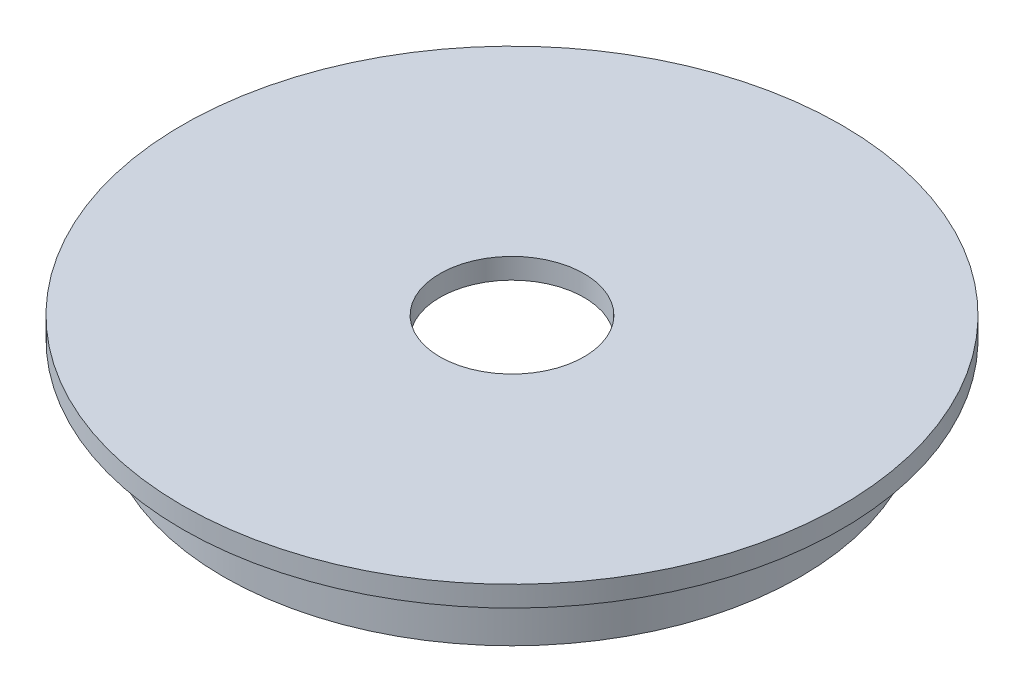
ISO-10303-21;
HEADER;
FILE_DESCRIPTION(('STEP AP214'),'2;1');
FILE_NAME('part.step','',(''),(''),'','','');
FILE_SCHEMA(('AUTOMOTIVE_DESIGN { 1 0 10303 214 1 1 1 1 }'));
ENDSEC;
DATA;
#1=APPLICATION_CONTEXT('core data for automotive mechanical design processes');
#2=APPLICATION_PROTOCOL_DEFINITION('international standard','automotive_design',2000,#1);
#3=PRODUCT_CONTEXT('',#1,'mechanical');
#4=PRODUCT('Part','Part','',(#3));
#5=PRODUCT_RELATED_PRODUCT_CATEGORY('part','',(#4));
#6=PRODUCT_DEFINITION_FORMATION('','',#4);
#7=PRODUCT_DEFINITION_CONTEXT('part definition',#1,'design');
#8=PRODUCT_DEFINITION('design','',#6,#7);
#9=PRODUCT_DEFINITION_SHAPE('','',#8);
#10=(LENGTH_UNIT() NAMED_UNIT(*) SI_UNIT(.MILLI.,.METRE.));
#11=(NAMED_UNIT(*) PLANE_ANGLE_UNIT() SI_UNIT($,.RADIAN.));
#12=(NAMED_UNIT(*) SI_UNIT($,.STERADIAN.) SOLID_ANGLE_UNIT());
#13=UNCERTAINTY_MEASURE_WITH_UNIT(LENGTH_MEASURE(1.E-05),#10,'distance_accuracy_value','');
#14=(GEOMETRIC_REPRESENTATION_CONTEXT(3) GLOBAL_UNCERTAINTY_ASSIGNED_CONTEXT((#13)) GLOBAL_UNIT_ASSIGNED_CONTEXT((#10,
#11,#12)) REPRESENTATION_CONTEXT('',''));
#15=CARTESIAN_POINT('',(0.,0.,0.));
#16=DIRECTION('',(0.,0.,1.));
#17=DIRECTION('',(1.,0.,0.));
#18=AXIS2_PLACEMENT_3D('',#15,#16,#17);
#19=CARTESIAN_POINT('',(0.,0.,0.));
#20=DIRECTION('',(0.,-1.,0.));
#21=DIRECTION('',(0.,0.,-1.));
#22=AXIS2_PLACEMENT_3D('',#19,#20,#21);
#23=PLANE('',#22);
#24=CARTESIAN_POINT('',(0.,0.,0.));
#25=DIRECTION('',(0.,1.,0.));
#26=DIRECTION('',(0.,0.,1.));
#27=AXIS2_PLACEMENT_3D('',#24,#25,#26);
#28=CIRCLE('',#27,11.1125);
#29=CARTESIAN_POINT('',(0.,0.,11.1125));
#30=VERTEX_POINT('',#29);
#31=EDGE_CURVE('E56',#30,#30,#28,.T.);
#32=ORIENTED_EDGE('',*,*,#31,.F.);
#33=EDGE_LOOP('',(#32));
#34=FACE_BOUND('',#33,.T.);
#35=CARTESIAN_POINT('',(0.,0.,0.));
#36=DIRECTION('',(0.,-1.,0.));
#37=DIRECTION('',(0.,0.,-1.));
#38=AXIS2_PLACEMENT_3D('',#35,#36,#37);
#39=CIRCLE('',#38,50.8);
#40=CARTESIAN_POINT('',(0.,0.,-50.8));
#41=VERTEX_POINT('',#40);
#42=EDGE_CURVE('E10',#41,#41,#39,.T.);
#43=ORIENTED_EDGE('',*,*,#42,.F.);
#44=EDGE_LOOP('',(#43));
#45=FACE_BOUND('',#44,.T.);
#46=ADVANCED_FACE('F31',(#34,#45),#23,.F.);
#47=CARTESIAN_POINT('',(0.,-12.7,0.));
#48=DIRECTION('',(0.,-1.,0.));
#49=DIRECTION('',(0.,0.,-1.));
#50=AXIS2_PLACEMENT_3D('',#47,#48,#49);
#51=CYLINDRICAL_SURFACE('',#50,50.8);
#52=CARTESIAN_POINT('',(0.,-3.17500000000001,0.));
#53=DIRECTION('',(0.,-1.,0.));
#54=DIRECTION('',(0.,0.,-1.));
#55=AXIS2_PLACEMENT_3D('',#52,#53,#54);
#56=CIRCLE('',#55,50.8);
#57=CARTESIAN_POINT('',(0.,-3.17500000000001,-50.8));
#58=VERTEX_POINT('',#57);
#59=EDGE_CURVE('E38',#58,#58,#56,.T.);
#60=ORIENTED_EDGE('',*,*,#59,.F.);
#61=EDGE_LOOP('',(#60));
#62=FACE_BOUND('',#61,.T.);
#63=ORIENTED_EDGE('',*,*,#42,.T.);
#64=EDGE_LOOP('',(#63));
#65=FACE_BOUND('',#64,.T.);
#66=ADVANCED_FACE('F76',(#62,#65),#51,.T.);
#67=CARTESIAN_POINT('',(-50.8,-3.17500000000001,0.));
#68=DIRECTION('',(0.,1.,0.));
#69=DIRECTION('',(0.,0.,1.));
#70=AXIS2_PLACEMENT_3D('',#67,#68,#69);
#71=PLANE('',#70);
#72=CARTESIAN_POINT('',(0.,-3.17500000000001,0.));
#73=DIRECTION('',(0.,-1.,0.));
#74=DIRECTION('',(0.,0.,-1.));
#75=AXIS2_PLACEMENT_3D('',#72,#73,#74);
#76=CIRCLE('',#75,44.45);
#77=CARTESIAN_POINT('',(0.,-3.17500000000001,-44.45));
#78=VERTEX_POINT('',#77);
#79=EDGE_CURVE('E42',#78,#78,#76,.T.);
#80=ORIENTED_EDGE('',*,*,#79,.F.);
#81=EDGE_LOOP('',(#80));
#82=FACE_BOUND('',#81,.T.);
#83=ORIENTED_EDGE('',*,*,#59,.T.);
#84=EDGE_LOOP('',(#83));
#85=FACE_BOUND('',#84,.T.);
#86=ADVANCED_FACE('F83',(#82,#85),#71,.F.);
#87=CARTESIAN_POINT('',(0.,-12.7,0.));
#88=DIRECTION('',(0.,-1.,0.));
#89=DIRECTION('',(0.,0.,-1.));
#90=AXIS2_PLACEMENT_3D('',#87,#88,#89);
#91=CYLINDRICAL_SURFACE('',#90,44.45);
#92=CARTESIAN_POINT('',(0.,-12.7,0.));
#93=DIRECTION('',(0.,-1.,0.));
#94=DIRECTION('',(0.,0.,-1.));
#95=AXIS2_PLACEMENT_3D('',#92,#93,#94);
#96=CIRCLE('',#95,44.45);
#97=CARTESIAN_POINT('',(0.,-12.7,-44.45));
#98=VERTEX_POINT('',#97);
#99=EDGE_CURVE('E47',#98,#98,#96,.T.);
#100=ORIENTED_EDGE('',*,*,#99,.F.);
#101=EDGE_LOOP('',(#100));
#102=FACE_BOUND('',#101,.T.);
#103=ORIENTED_EDGE('',*,*,#79,.T.);
#104=EDGE_LOOP('',(#103));
#105=FACE_BOUND('',#104,.T.);
#106=ADVANCED_FACE('F89',(#102,#105),#91,.T.);
#107=CARTESIAN_POINT('',(-44.45,-12.7,0.));
#108=DIRECTION('',(0.,1.,0.));
#109=DIRECTION('',(0.,0.,1.));
#110=AXIS2_PLACEMENT_3D('',#107,#108,#109);
#111=PLANE('',#110);
#112=CARTESIAN_POINT('',(0.,-12.7,0.));
#113=DIRECTION('',(0.,-1.,0.));
#114=DIRECTION('',(0.,0.,-1.));
#115=AXIS2_PLACEMENT_3D('',#112,#113,#114);
#116=CIRCLE('',#115,41.275);
#117=CARTESIAN_POINT('',(0.,-12.7,-41.275));
#118=VERTEX_POINT('',#117);
#119=EDGE_CURVE('E53',#118,#118,#116,.T.);
#120=ORIENTED_EDGE('',*,*,#119,.F.);
#121=EDGE_LOOP('',(#120));
#122=FACE_BOUND('',#121,.T.);
#123=ORIENTED_EDGE('',*,*,#99,.T.);
#124=EDGE_LOOP('',(#123));
#125=FACE_BOUND('',#124,.T.);
#126=ADVANCED_FACE('F96',(#122,#125),#111,.F.);
#127=CARTESIAN_POINT('',(-50.8,-3.17500000000001,0.));
#128=DIRECTION('',(0.,1.,0.));
#129=DIRECTION('',(0.,0.,1.));
#130=AXIS2_PLACEMENT_3D('',#127,#128,#129);
#131=PLANE('',#130);
#132=CARTESIAN_POINT('',(0.,-3.17500000000001,0.));
#133=DIRECTION('',(0.,1.,0.));
#134=DIRECTION('',(0.,0.,1.));
#135=AXIS2_PLACEMENT_3D('',#132,#133,#134);
#136=CIRCLE('',#135,11.1125);
#137=CARTESIAN_POINT('',(0.,-3.17500000000001,11.1125));
#138=VERTEX_POINT('',#137);
#139=EDGE_CURVE('E34',#138,#138,#136,.T.);
#140=ORIENTED_EDGE('',*,*,#139,.T.);
#141=EDGE_LOOP('',(#140));
#142=FACE_BOUND('',#141,.T.);
#143=CARTESIAN_POINT('',(0.,-3.17500000000001,0.));
#144=DIRECTION('',(0.,1.,0.));
#145=DIRECTION('',(0.,0.,1.));
#146=AXIS2_PLACEMENT_3D('',#143,#144,#145);
#147=CIRCLE('',#146,41.275);
#148=CARTESIAN_POINT('',(0.,-3.17500000000001,41.275));
#149=VERTEX_POINT('',#148);
#150=EDGE_CURVE('E50',#149,#149,#147,.F.);
#151=ORIENTED_EDGE('',*,*,#150,.T.);
#152=EDGE_LOOP('',(#151));
#153=FACE_BOUND('',#152,.T.);
#154=ADVANCED_FACE('F63',(#142,#153),#131,.F.);
#155=CARTESIAN_POINT('',(0.,113.568329573899,0.));
#156=DIRECTION('',(0.,-1.,0.));
#157=DIRECTION('',(0.,0.,-1.));
#158=AXIS2_PLACEMENT_3D('',#155,#156,#157);
#159=CYLINDRICAL_SURFACE('',#158,41.275);
#160=ORIENTED_EDGE('',*,*,#119,.T.);
#161=EDGE_LOOP('',(#160));
#162=FACE_BOUND('',#161,.T.);
#163=ORIENTED_EDGE('',*,*,#150,.F.);
#164=EDGE_LOOP('',(#163));
#165=FACE_BOUND('',#164,.T.);
#166=ADVANCED_FACE('F68',(#162,#165),#159,.F.);
#167=CARTESIAN_POINT('',(0.,-12.7,0.));
#168=DIRECTION('',(0.,1.,0.));
#169=DIRECTION('',(0.,0.,1.));
#170=AXIS2_PLACEMENT_3D('',#167,#168,#169);
#171=CYLINDRICAL_SURFACE('',#170,11.1125);
#172=ORIENTED_EDGE('',*,*,#31,.T.);
#173=EDGE_LOOP('',(#172));
#174=FACE_BOUND('',#173,.T.);
#175=ORIENTED_EDGE('',*,*,#139,.F.);
#176=EDGE_LOOP('',(#175));
#177=FACE_BOUND('',#176,.T.);
#178=ADVANCED_FACE('F66',(#174,#177),#171,.F.);
#179=CLOSED_SHELL('',(#46,#66,#86,#106,#126,#154,#166,#178));
#180=MANIFOLD_SOLID_BREP('B2',#179);
#181=ADVANCED_BREP_SHAPE_REPRESENTATION('',(#18,#180),#14);
#182=SHAPE_DEFINITION_REPRESENTATION(#9,#181);
ENDSEC;
END-ISO-10303-21;
